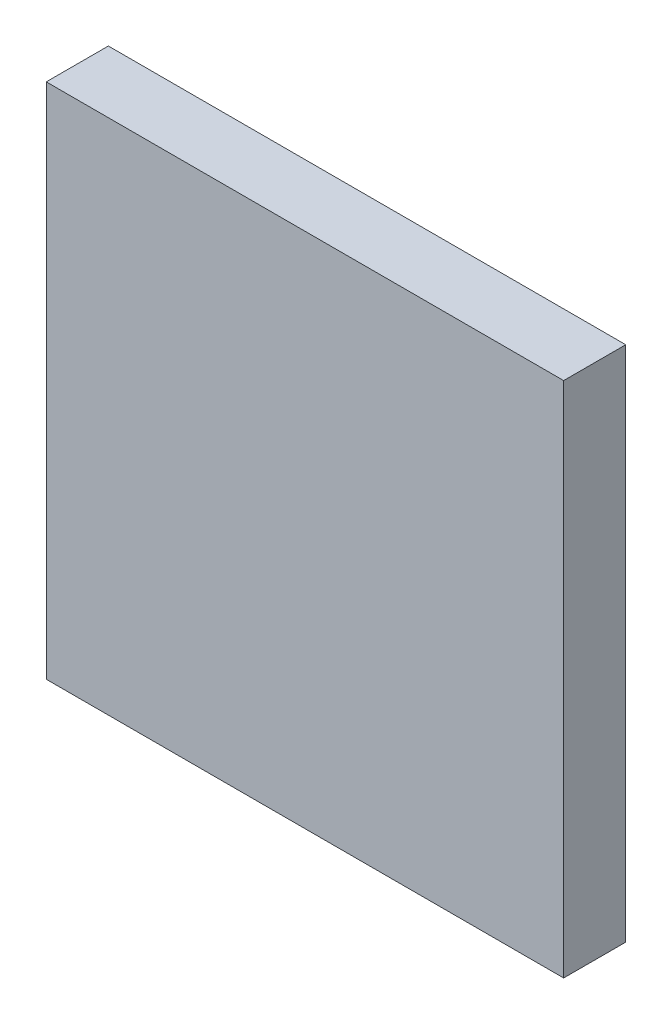
ISO-10303-21;
HEADER;
FILE_DESCRIPTION(('STEP AP214'),'2;1');
FILE_NAME('part.step','',(''),(''),'','','');
FILE_SCHEMA(('AUTOMOTIVE_DESIGN { 1 0 10303 214 1 1 1 1 }'));
ENDSEC;
DATA;
#1=APPLICATION_CONTEXT('core data for automotive mechanical design processes');
#2=APPLICATION_PROTOCOL_DEFINITION('international standard','automotive_design',2000,#1);
#3=PRODUCT_CONTEXT('',#1,'mechanical');
#4=PRODUCT('Part','Part','',(#3));
#5=PRODUCT_RELATED_PRODUCT_CATEGORY('part','',(#4));
#6=PRODUCT_DEFINITION_FORMATION('','',#4);
#7=PRODUCT_DEFINITION_CONTEXT('part definition',#1,'design');
#8=PRODUCT_DEFINITION('design','',#6,#7);
#9=PRODUCT_DEFINITION_SHAPE('','',#8);
#10=(LENGTH_UNIT() NAMED_UNIT(*) SI_UNIT(.MILLI.,.METRE.));
#11=(NAMED_UNIT(*) PLANE_ANGLE_UNIT() SI_UNIT($,.RADIAN.));
#12=(NAMED_UNIT(*) SI_UNIT($,.STERADIAN.) SOLID_ANGLE_UNIT());
#13=UNCERTAINTY_MEASURE_WITH_UNIT(LENGTH_MEASURE(1.E-05),#10,'distance_accuracy_value','');
#14=(GEOMETRIC_REPRESENTATION_CONTEXT(3) GLOBAL_UNCERTAINTY_ASSIGNED_CONTEXT((#13)) GLOBAL_UNIT_ASSIGNED_CONTEXT((#10,
#11,#12)) REPRESENTATION_CONTEXT('',''));
#15=CARTESIAN_POINT('',(0.,0.,0.));
#16=DIRECTION('',(0.,0.,1.));
#17=DIRECTION('',(1.,0.,0.));
#18=AXIS2_PLACEMENT_3D('',#15,#16,#17);
#19=CARTESIAN_POINT('',(-5.00000016,-5.00000016,0.));
#20=DIRECTION('',(0.,1.,0.));
#21=DIRECTION('',(1.,0.,0.));
#22=AXIS2_PLACEMENT_3D('',#19,#20,#21);
#23=PLANE('',#22);
#24=DIRECTION('',(1.,0.,0.));
#25=VECTOR('',#24,1.);
#26=CARTESIAN_POINT('',(-5.00000016,-5.00000016,0.));
#27=LINE('',#26,#25);
#28=CARTESIAN_POINT('',(-5.00000016,-5.00000016,0.));
#29=VERTEX_POINT('',#28);
#30=CARTESIAN_POINT('',(5.00000016,-5.00000016,0.));
#31=VERTEX_POINT('',#30);
#32=EDGE_CURVE('E9',#29,#31,#27,.T.);
#33=ORIENTED_EDGE('',*,*,#32,.T.);
#34=DIRECTION('',(0.,0.,1.));
#35=VECTOR('',#34,1.);
#36=CARTESIAN_POINT('',(5.00000016,-5.00000016,0.));
#37=LINE('',#36,#35);
#38=CARTESIAN_POINT('',(5.00000016,-5.00000016,1.20000014));
#39=VERTEX_POINT('',#38);
#40=EDGE_CURVE('E22',#31,#39,#37,.T.);
#41=ORIENTED_EDGE('',*,*,#40,.T.);
#42=DIRECTION('',(1.,0.,0.));
#43=VECTOR('',#42,1.);
#44=CARTESIAN_POINT('',(-5.00000016,-5.00000016,1.20000014));
#45=LINE('',#44,#43);
#46=CARTESIAN_POINT('',(-5.00000016,-5.00000016,1.20000014));
#47=VERTEX_POINT('',#46);
#48=EDGE_CURVE('E84',#47,#39,#45,.T.);
#49=ORIENTED_EDGE('',*,*,#48,.F.);
#50=DIRECTION('',(0.,0.,1.));
#51=VECTOR('',#50,1.);
#52=CARTESIAN_POINT('',(-5.00000016,-5.00000016,0.));
#53=LINE('',#52,#51);
#54=EDGE_CURVE('E35',#29,#47,#53,.T.);
#55=ORIENTED_EDGE('',*,*,#54,.F.);
#56=EDGE_LOOP('',(#33,#41,#49,#55));
#57=FACE_BOUND('',#56,.T.);
#58=ADVANCED_FACE('F15',(#57),#23,.F.);
#59=CARTESIAN_POINT('',(5.00000016,-5.00000016,0.));
#60=DIRECTION('',(-1.,0.,0.));
#61=DIRECTION('',(0.,1.,0.));
#62=AXIS2_PLACEMENT_3D('',#59,#60,#61);
#63=PLANE('',#62);
#64=DIRECTION('',(0.,1.,0.));
#65=VECTOR('',#64,1.);
#66=CARTESIAN_POINT('',(5.00000016,-5.00000016,0.));
#67=LINE('',#66,#65);
#68=CARTESIAN_POINT('',(5.00000016,5.00000016,0.));
#69=VERTEX_POINT('',#68);
#70=EDGE_CURVE('E29',#31,#69,#67,.T.);
#71=ORIENTED_EDGE('',*,*,#70,.T.);
#72=DIRECTION('',(0.,0.,1.));
#73=VECTOR('',#72,1.);
#74=CARTESIAN_POINT('',(5.00000016,5.00000016,0.));
#75=LINE('',#74,#73);
#76=CARTESIAN_POINT('',(5.00000016,5.00000016,1.20000014));
#77=VERTEX_POINT('',#76);
#78=EDGE_CURVE('E80',#69,#77,#75,.T.);
#79=ORIENTED_EDGE('',*,*,#78,.T.);
#80=DIRECTION('',(0.,1.,0.));
#81=VECTOR('',#80,1.);
#82=CARTESIAN_POINT('',(5.00000016,-5.00000016,1.20000014));
#83=LINE('',#82,#81);
#84=EDGE_CURVE('E61',#39,#77,#83,.T.);
#85=ORIENTED_EDGE('',*,*,#84,.F.);
#86=ORIENTED_EDGE('',*,*,#40,.F.);
#87=EDGE_LOOP('',(#71,#79,#85,#86));
#88=FACE_BOUND('',#87,.T.);
#89=ADVANCED_FACE('F88',(#88),#63,.F.);
#90=CARTESIAN_POINT('',(5.00000016,5.00000016,0.));
#91=DIRECTION('',(0.,-1.,0.));
#92=DIRECTION('',(-1.,0.,0.));
#93=AXIS2_PLACEMENT_3D('',#90,#91,#92);
#94=PLANE('',#93);
#95=DIRECTION('',(-1.,0.,0.));
#96=VECTOR('',#95,1.);
#97=CARTESIAN_POINT('',(5.00000016,5.00000016,0.));
#98=LINE('',#97,#96);
#99=CARTESIAN_POINT('',(-5.00000016,5.00000016,0.));
#100=VERTEX_POINT('',#99);
#101=EDGE_CURVE('E69',#69,#100,#98,.T.);
#102=ORIENTED_EDGE('',*,*,#101,.T.);
#103=DIRECTION('',(0.,0.,1.));
#104=VECTOR('',#103,1.);
#105=CARTESIAN_POINT('',(-5.00000016,5.00000016,0.));
#106=LINE('',#105,#104);
#107=CARTESIAN_POINT('',(-5.00000016,5.00000016,1.20000014));
#108=VERTEX_POINT('',#107);
#109=EDGE_CURVE('E64',#100,#108,#106,.T.);
#110=ORIENTED_EDGE('',*,*,#109,.T.);
#111=DIRECTION('',(-1.,0.,0.));
#112=VECTOR('',#111,1.);
#113=CARTESIAN_POINT('',(5.00000016,5.00000016,1.20000014));
#114=LINE('',#113,#112);
#115=EDGE_CURVE('E55',#77,#108,#114,.T.);
#116=ORIENTED_EDGE('',*,*,#115,.F.);
#117=ORIENTED_EDGE('',*,*,#78,.F.);
#118=EDGE_LOOP('',(#102,#110,#116,#117));
#119=FACE_BOUND('',#118,.T.);
#120=ADVANCED_FACE('F68',(#119),#94,.F.);
#121=CARTESIAN_POINT('',(-5.00000016,5.00000016,0.));
#122=DIRECTION('',(1.,0.,0.));
#123=DIRECTION('',(0.,-1.,0.));
#124=AXIS2_PLACEMENT_3D('',#121,#122,#123);
#125=PLANE('',#124);
#126=DIRECTION('',(0.,-1.,0.));
#127=VECTOR('',#126,1.);
#128=CARTESIAN_POINT('',(-5.00000016,5.00000016,0.));
#129=LINE('',#128,#127);
#130=EDGE_CURVE('E65',#100,#29,#129,.T.);
#131=ORIENTED_EDGE('',*,*,#130,.T.);
#132=ORIENTED_EDGE('',*,*,#54,.T.);
#133=DIRECTION('',(0.,-1.,0.));
#134=VECTOR('',#133,1.);
#135=CARTESIAN_POINT('',(-5.00000016,5.00000016,1.20000014));
#136=LINE('',#135,#134);
#137=EDGE_CURVE('E59',#108,#47,#136,.T.);
#138=ORIENTED_EDGE('',*,*,#137,.F.);
#139=ORIENTED_EDGE('',*,*,#109,.F.);
#140=EDGE_LOOP('',(#131,#132,#138,#139));
#141=FACE_BOUND('',#140,.T.);
#142=ADVANCED_FACE('F74',(#141),#125,.F.);
#143=CARTESIAN_POINT('',(-5.00000016,-5.00000016,0.));
#144=DIRECTION('',(0.,0.,-1.));
#145=DIRECTION('',(-1.,0.,0.));
#146=AXIS2_PLACEMENT_3D('',#143,#144,#145);
#147=PLANE('',#146);
#148=ORIENTED_EDGE('',*,*,#130,.F.);
#149=ORIENTED_EDGE('',*,*,#101,.F.);
#150=ORIENTED_EDGE('',*,*,#70,.F.);
#151=ORIENTED_EDGE('',*,*,#32,.F.);
#152=EDGE_LOOP('',(#148,#149,#150,#151));
#153=FACE_BOUND('',#152,.T.);
#154=ADVANCED_FACE('F89',(#153),#147,.T.);
#155=CARTESIAN_POINT('',(-5.00000016,-5.00000016,1.20000014));
#156=DIRECTION('',(0.,0.,-1.));
#157=DIRECTION('',(-1.,0.,0.));
#158=AXIS2_PLACEMENT_3D('',#155,#156,#157);
#159=PLANE('',#158);
#160=ORIENTED_EDGE('',*,*,#48,.T.);
#161=ORIENTED_EDGE('',*,*,#84,.T.);
#162=ORIENTED_EDGE('',*,*,#115,.T.);
#163=ORIENTED_EDGE('',*,*,#137,.T.);
#164=EDGE_LOOP('',(#160,#161,#162,#163));
#165=FACE_BOUND('',#164,.T.);
#166=ADVANCED_FACE('F57',(#165),#159,.F.);
#167=CLOSED_SHELL('',(#58,#89,#120,#142,#154,#166));
#168=MANIFOLD_SOLID_BREP('B1',#167);
#169=ADVANCED_BREP_SHAPE_REPRESENTATION('',(#18,#168),#14);
#170=SHAPE_DEFINITION_REPRESENTATION(#9,#169);
ENDSEC;
END-ISO-10303-21;
